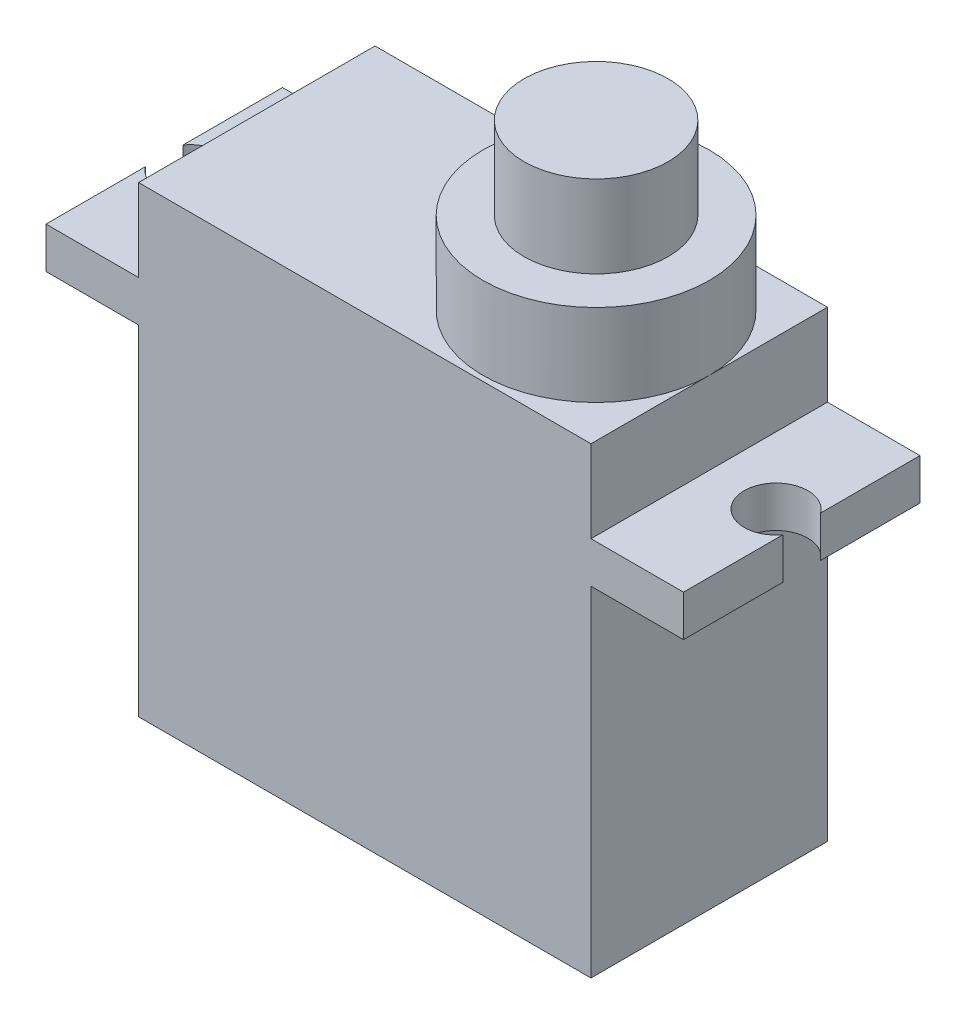
ISO-10303-21;
HEADER;
FILE_DESCRIPTION(('STEP AP214'),'2;1');
FILE_NAME('part.step','',(''),(''),'','','');
FILE_SCHEMA(('AUTOMOTIVE_DESIGN { 1 0 10303 214 1 1 1 1 }'));
ENDSEC;
DATA;
#1=APPLICATION_CONTEXT('core data for automotive mechanical design processes');
#2=APPLICATION_PROTOCOL_DEFINITION('international standard','automotive_design',2000,#1);
#3=PRODUCT_CONTEXT('',#1,'mechanical');
#4=PRODUCT('Part','Part','',(#3));
#5=PRODUCT_RELATED_PRODUCT_CATEGORY('part','',(#4));
#6=PRODUCT_DEFINITION_FORMATION('','',#4);
#7=PRODUCT_DEFINITION_CONTEXT('part definition',#1,'design');
#8=PRODUCT_DEFINITION('design','',#6,#7);
#9=PRODUCT_DEFINITION_SHAPE('','',#8);
#10=(LENGTH_UNIT() NAMED_UNIT(*) SI_UNIT(.MILLI.,.METRE.));
#11=(NAMED_UNIT(*) PLANE_ANGLE_UNIT() SI_UNIT($,.RADIAN.));
#12=(NAMED_UNIT(*) SI_UNIT($,.STERADIAN.) SOLID_ANGLE_UNIT());
#13=UNCERTAINTY_MEASURE_WITH_UNIT(LENGTH_MEASURE(1.E-05),#10,'distance_accuracy_value','');
#14=(GEOMETRIC_REPRESENTATION_CONTEXT(3) GLOBAL_UNCERTAINTY_ASSIGNED_CONTEXT((#13)) GLOBAL_UNIT_ASSIGNED_CONTEXT((#10,
#11,#12)) REPRESENTATION_CONTEXT('',''));
#15=CARTESIAN_POINT('',(0.,0.,0.));
#16=DIRECTION('',(0.,0.,1.));
#17=DIRECTION('',(1.,0.,0.));
#18=AXIS2_PLACEMENT_3D('',#15,#16,#17);
#19=CARTESIAN_POINT('',(-14.25,18.5,0.));
#20=DIRECTION('',(0.,1.,0.));
#21=DIRECTION('',(0.,0.,1.));
#22=AXIS2_PLACEMENT_3D('',#19,#20,#21);
#23=PLANE('',#22);
#24=DIRECTION('',(0.,0.,1.));
#25=VECTOR('',#24,1.);
#26=CARTESIAN_POINT('',(-11.,18.5,-5.75));
#27=LINE('',#26,#25);
#28=CARTESIAN_POINT('',(-11.,18.5,-5.75));
#29=VERTEX_POINT('',#28);
#30=CARTESIAN_POINT('',(-11.,18.5,5.75));
#31=VERTEX_POINT('',#30);
#32=EDGE_CURVE('E169',#29,#31,#27,.T.);
#33=ORIENTED_EDGE('',*,*,#32,.F.);
#34=DIRECTION('',(-1.,0.,0.));
#35=VECTOR('',#34,1.);
#36=CARTESIAN_POINT('',(-15.5,18.5,-5.75));
#37=LINE('',#36,#35);
#38=CARTESIAN_POINT('',(-15.5,18.5,-5.75));
#39=VERTEX_POINT('',#38);
#40=EDGE_CURVE('E197',#29,#39,#37,.T.);
#41=ORIENTED_EDGE('',*,*,#40,.T.);
#42=DIRECTION('',(0.,0.,1.));
#43=VECTOR('',#42,1.);
#44=CARTESIAN_POINT('',(-15.5,18.5,-5.75));
#45=LINE('',#44,#43);
#46=CARTESIAN_POINT('',(-15.5,18.5,-0.916515138991163));
#47=VERTEX_POINT('',#46);
#48=EDGE_CURVE('E200',#39,#47,#45,.T.);
#49=ORIENTED_EDGE('',*,*,#48,.T.);
#50=CARTESIAN_POINT('',(-14.25,18.5,0.));
#51=DIRECTION('',(0.,-1.,0.));
#52=DIRECTION('',(0.,0.,1.));
#53=AXIS2_PLACEMENT_3D('',#50,#51,#52);
#54=CIRCLE('',#53,1.55);
#55=CARTESIAN_POINT('',(-15.5,18.5,0.916515138991162));
#56=VERTEX_POINT('',#55);
#57=EDGE_CURVE('E202',#47,#56,#54,.T.);
#58=ORIENTED_EDGE('',*,*,#57,.T.);
#59=DIRECTION('',(0.,0.,1.));
#60=VECTOR('',#59,1.);
#61=CARTESIAN_POINT('',(-15.5,18.5,0.916515138991162));
#62=LINE('',#61,#60);
#63=CARTESIAN_POINT('',(-15.5,18.5,5.75));
#64=VERTEX_POINT('',#63);
#65=EDGE_CURVE('E204',#56,#64,#62,.T.);
#66=ORIENTED_EDGE('',*,*,#65,.T.);
#67=DIRECTION('',(1.,0.,0.));
#68=VECTOR('',#67,1.);
#69=CARTESIAN_POINT('',(-15.5,18.5,5.75));
#70=LINE('',#69,#68);
#71=EDGE_CURVE('E58',#64,#31,#70,.T.);
#72=ORIENTED_EDGE('',*,*,#71,.T.);
#73=EDGE_LOOP('',(#33,#41,#49,#58,#66,#72));
#74=FACE_BOUND('',#73,.T.);
#75=ADVANCED_FACE('F34',(#74),#23,.T.);
#76=CARTESIAN_POINT('',(-11.,16.5,-5.75));
#77=DIRECTION('',(1.,0.,0.));
#78=DIRECTION('',(0.,0.,-1.));
#79=AXIS2_PLACEMENT_3D('',#76,#77,#78);
#80=PLANE('',#79);
#81=DIRECTION('',(0.,0.,1.));
#82=VECTOR('',#81,1.);
#83=CARTESIAN_POINT('',(-11.,0.,-5.75));
#84=LINE('',#83,#82);
#85=CARTESIAN_POINT('',(-11.,0.,-5.75));
#86=VERTEX_POINT('',#85);
#87=CARTESIAN_POINT('',(-11.,0.,5.75));
#88=VERTEX_POINT('',#87);
#89=EDGE_CURVE('E251',#86,#88,#84,.T.);
#90=ORIENTED_EDGE('',*,*,#89,.T.);
#91=DIRECTION('',(0.,-1.,0.));
#92=VECTOR('',#91,1.);
#93=CARTESIAN_POINT('',(-11.,16.5,5.75));
#94=LINE('',#93,#92);
#95=CARTESIAN_POINT('',(-11.,16.5,5.75));
#96=VERTEX_POINT('',#95);
#97=EDGE_CURVE('E38',#96,#88,#94,.T.);
#98=ORIENTED_EDGE('',*,*,#97,.F.);
#99=DIRECTION('',(0.,0.,1.));
#100=VECTOR('',#99,1.);
#101=CARTESIAN_POINT('',(-11.,16.5,-5.75));
#102=LINE('',#101,#100);
#103=CARTESIAN_POINT('',(-11.,16.5,-5.75));
#104=VERTEX_POINT('',#103);
#105=EDGE_CURVE('E252',#104,#96,#102,.T.);
#106=ORIENTED_EDGE('',*,*,#105,.F.);
#107=DIRECTION('',(0.,-1.,0.));
#108=VECTOR('',#107,1.);
#109=CARTESIAN_POINT('',(-11.,16.5,-5.75));
#110=LINE('',#109,#108);
#111=EDGE_CURVE('E259',#104,#86,#110,.T.);
#112=ORIENTED_EDGE('',*,*,#111,.T.);
#113=EDGE_LOOP('',(#90,#98,#106,#112));
#114=FACE_BOUND('',#113,.T.);
#115=ADVANCED_FACE('F36',(#114),#80,.F.);
#116=CARTESIAN_POINT('',(-11.,16.5,5.75));
#117=DIRECTION('',(0.,0.,-1.));
#118=DIRECTION('',(-1.,0.,0.));
#119=AXIS2_PLACEMENT_3D('',#116,#117,#118);
#120=PLANE('',#119);
#121=DIRECTION('',(1.,0.,0.));
#122=VECTOR('',#121,1.);
#123=CARTESIAN_POINT('',(-11.,0.,5.75));
#124=LINE('',#123,#122);
#125=CARTESIAN_POINT('',(11.,0.,5.75));
#126=VERTEX_POINT('',#125);
#127=EDGE_CURVE('E262',#88,#126,#124,.T.);
#128=ORIENTED_EDGE('',*,*,#127,.T.);
#129=DIRECTION('',(0.,-1.,0.));
#130=VECTOR('',#129,1.);
#131=CARTESIAN_POINT('',(11.,16.5,5.75));
#132=LINE('',#131,#130);
#133=CARTESIAN_POINT('',(11.,16.5,5.75));
#134=VERTEX_POINT('',#133);
#135=EDGE_CURVE('E271',#134,#126,#132,.T.);
#136=ORIENTED_EDGE('',*,*,#135,.F.);
#137=DIRECTION('',(1.,0.,0.));
#138=VECTOR('',#137,1.);
#139=CARTESIAN_POINT('',(-15.5,16.5,5.75));
#140=LINE('',#139,#138);
#141=CARTESIAN_POINT('',(15.5,16.5,5.75000000000001));
#142=VERTEX_POINT('',#141);
#143=EDGE_CURVE('E225',#134,#142,#140,.T.);
#144=ORIENTED_EDGE('',*,*,#143,.T.);
#145=DIRECTION('',(0.,-1.,0.));
#146=VECTOR('',#145,1.);
#147=CARTESIAN_POINT('',(15.5,18.5,5.75000000000001));
#148=LINE('',#147,#146);
#149=CARTESIAN_POINT('',(15.5,18.5,5.75000000000001));
#150=VERTEX_POINT('',#149);
#151=EDGE_CURVE('E208',#150,#142,#148,.T.);
#152=ORIENTED_EDGE('',*,*,#151,.F.);
#153=CARTESIAN_POINT('',(11.,18.5,5.75000000000001));
#154=VERTEX_POINT('',#153);
#155=EDGE_CURVE('E206',#154,#150,#70,.T.);
#156=ORIENTED_EDGE('',*,*,#155,.F.);
#157=DIRECTION('',(0.,-1.,0.));
#158=VECTOR('',#157,1.);
#159=CARTESIAN_POINT('',(11.,22.5,5.75));
#160=LINE('',#159,#158);
#161=CARTESIAN_POINT('',(11.,22.5,5.75));
#162=VERTEX_POINT('',#161);
#163=EDGE_CURVE('E186',#162,#154,#160,.T.);
#164=ORIENTED_EDGE('',*,*,#163,.F.);
#165=DIRECTION('',(1.,0.,0.));
#166=VECTOR('',#165,1.);
#167=CARTESIAN_POINT('',(-11.,22.5,5.75));
#168=LINE('',#167,#166);
#169=CARTESIAN_POINT('',(-11.,22.5,5.75));
#170=VERTEX_POINT('',#169);
#171=EDGE_CURVE('E157',#170,#162,#168,.T.);
#172=ORIENTED_EDGE('',*,*,#171,.F.);
#173=DIRECTION('',(0.,-1.,0.));
#174=VECTOR('',#173,1.);
#175=CARTESIAN_POINT('',(-11.,22.5,5.75));
#176=LINE('',#175,#174);
#177=EDGE_CURVE('E176',#170,#31,#176,.T.);
#178=ORIENTED_EDGE('',*,*,#177,.T.);
#179=ORIENTED_EDGE('',*,*,#71,.F.);
#180=DIRECTION('',(0.,-1.,0.));
#181=VECTOR('',#180,1.);
#182=CARTESIAN_POINT('',(-15.5,18.5,5.75));
#183=LINE('',#182,#181);
#184=CARTESIAN_POINT('',(-15.5,16.5,5.75));
#185=VERTEX_POINT('',#184);
#186=EDGE_CURVE('E230',#64,#185,#183,.T.);
#187=ORIENTED_EDGE('',*,*,#186,.T.);
#188=EDGE_CURVE('E193',#185,#96,#140,.T.);
#189=ORIENTED_EDGE('',*,*,#188,.T.);
#190=ORIENTED_EDGE('',*,*,#97,.T.);
#191=EDGE_LOOP('',(#128,#136,#144,#152,#156,#164,#172,#178,#179,#187,#189,#190));
#192=FACE_BOUND('',#191,.T.);
#193=ADVANCED_FACE('F278',(#192),#120,.F.);
#194=CARTESIAN_POINT('',(11.,16.5,-5.75));
#195=DIRECTION('',(-1.,0.,0.));
#196=DIRECTION('',(0.,0.,1.));
#197=AXIS2_PLACEMENT_3D('',#194,#195,#196);
#198=PLANE('',#197);
#199=DIRECTION('',(0.,0.,-1.));
#200=VECTOR('',#199,1.);
#201=CARTESIAN_POINT('',(11.,0.,-5.75));
#202=LINE('',#201,#200);
#203=CARTESIAN_POINT('',(11.,0.,-5.75));
#204=VERTEX_POINT('',#203);
#205=EDGE_CURVE('E264',#126,#204,#202,.T.);
#206=ORIENTED_EDGE('',*,*,#205,.T.);
#207=DIRECTION('',(0.,-1.,0.));
#208=VECTOR('',#207,1.);
#209=CARTESIAN_POINT('',(11.,16.5,-5.75));
#210=LINE('',#209,#208);
#211=CARTESIAN_POINT('',(11.,16.5,-5.75000000000001));
#212=VERTEX_POINT('',#211);
#213=EDGE_CURVE('E269',#212,#204,#210,.T.);
#214=ORIENTED_EDGE('',*,*,#213,.F.);
#215=DIRECTION('',(0.,0.,-1.));
#216=VECTOR('',#215,1.);
#217=CARTESIAN_POINT('',(11.,16.5,-5.75));
#218=LINE('',#217,#216);
#219=EDGE_CURVE('E255',#134,#212,#218,.T.);
#220=ORIENTED_EDGE('',*,*,#219,.F.);
#221=ORIENTED_EDGE('',*,*,#135,.T.);
#222=EDGE_LOOP('',(#206,#214,#220,#221));
#223=FACE_BOUND('',#222,.T.);
#224=ADVANCED_FACE('F286',(#223),#198,.F.);
#225=CARTESIAN_POINT('',(-11.,16.5,-5.75));
#226=DIRECTION('',(0.,0.,1.));
#227=DIRECTION('',(1.,0.,0.));
#228=AXIS2_PLACEMENT_3D('',#225,#226,#227);
#229=PLANE('',#228);
#230=DIRECTION('',(-1.,0.,0.));
#231=VECTOR('',#230,1.);
#232=CARTESIAN_POINT('',(-11.,0.,-5.75));
#233=LINE('',#232,#231);
#234=EDGE_CURVE('E256',#204,#86,#233,.T.);
#235=ORIENTED_EDGE('',*,*,#234,.T.);
#236=ORIENTED_EDGE('',*,*,#111,.F.);
#237=DIRECTION('',(-1.,0.,0.));
#238=VECTOR('',#237,1.);
#239=CARTESIAN_POINT('',(-15.5,16.5,-5.75));
#240=LINE('',#239,#238);
#241=CARTESIAN_POINT('',(-15.5,16.5,-5.75));
#242=VERTEX_POINT('',#241);
#243=EDGE_CURVE('E215',#104,#242,#240,.T.);
#244=ORIENTED_EDGE('',*,*,#243,.T.);
#245=DIRECTION('',(0.,-1.,0.));
#246=VECTOR('',#245,1.);
#247=CARTESIAN_POINT('',(-15.5,18.5,-5.75));
#248=LINE('',#247,#246);
#249=EDGE_CURVE('E239',#39,#242,#248,.T.);
#250=ORIENTED_EDGE('',*,*,#249,.F.);
#251=ORIENTED_EDGE('',*,*,#40,.F.);
#252=DIRECTION('',(0.,-1.,0.));
#253=VECTOR('',#252,1.);
#254=CARTESIAN_POINT('',(-11.,22.5,-5.75));
#255=LINE('',#254,#253);
#256=CARTESIAN_POINT('',(-11.,22.5,-5.75));
#257=VERTEX_POINT('',#256);
#258=EDGE_CURVE('E182',#257,#29,#255,.T.);
#259=ORIENTED_EDGE('',*,*,#258,.F.);
#260=DIRECTION('',(-1.,0.,0.));
#261=VECTOR('',#260,1.);
#262=CARTESIAN_POINT('',(11.,22.5,-5.75));
#263=LINE('',#262,#261);
#264=CARTESIAN_POINT('',(11.,22.5,-5.75));
#265=VERTEX_POINT('',#264);
#266=EDGE_CURVE('E161',#265,#257,#263,.T.);
#267=ORIENTED_EDGE('',*,*,#266,.F.);
#268=DIRECTION('',(0.,-1.,0.));
#269=VECTOR('',#268,1.);
#270=CARTESIAN_POINT('',(11.,22.5,-5.75));
#271=LINE('',#270,#269);
#272=CARTESIAN_POINT('',(11.,18.5,-5.75));
#273=VERTEX_POINT('',#272);
#274=EDGE_CURVE('E167',#265,#273,#271,.T.);
#275=ORIENTED_EDGE('',*,*,#274,.T.);
#276=CARTESIAN_POINT('',(15.5,18.5,-5.75000000000001));
#277=VERTEX_POINT('',#276);
#278=EDGE_CURVE('E198',#277,#273,#37,.T.);
#279=ORIENTED_EDGE('',*,*,#278,.F.);
#280=DIRECTION('',(0.,-1.,0.));
#281=VECTOR('',#280,1.);
#282=CARTESIAN_POINT('',(15.5,18.5,-5.75000000000001));
#283=LINE('',#282,#281);
#284=CARTESIAN_POINT('',(15.5,16.5,-5.75000000000001));
#285=VERTEX_POINT('',#284);
#286=EDGE_CURVE('E242',#277,#285,#283,.T.);
#287=ORIENTED_EDGE('',*,*,#286,.T.);
#288=EDGE_CURVE('E216',#285,#212,#240,.T.);
#289=ORIENTED_EDGE('',*,*,#288,.T.);
#290=ORIENTED_EDGE('',*,*,#213,.T.);
#291=EDGE_LOOP('',(#235,#236,#244,#250,#251,#259,#267,#275,#279,#287,#289,#290));
#292=FACE_BOUND('',#291,.T.);
#293=ADVANCED_FACE('F288',(#292),#229,.F.);
#294=CARTESIAN_POINT('',(0.,0.,0.));
#295=DIRECTION('',(0.,1.,0.));
#296=DIRECTION('',(0.,0.,1.));
#297=AXIS2_PLACEMENT_3D('',#294,#295,#296);
#298=PLANE('',#297);
#299=ORIENTED_EDGE('',*,*,#89,.F.);
#300=ORIENTED_EDGE('',*,*,#234,.F.);
#301=ORIENTED_EDGE('',*,*,#205,.F.);
#302=ORIENTED_EDGE('',*,*,#127,.F.);
#303=EDGE_LOOP('',(#299,#300,#301,#302));
#304=FACE_BOUND('',#303,.T.);
#305=ADVANCED_FACE('F285',(#304),#298,.F.);
#306=CARTESIAN_POINT('',(-14.25,16.5,0.));
#307=DIRECTION('',(0.,1.,0.));
#308=DIRECTION('',(0.,0.,1.));
#309=AXIS2_PLACEMENT_3D('',#306,#307,#308);
#310=PLANE('',#309);
#311=ORIENTED_EDGE('',*,*,#243,.F.);
#312=ORIENTED_EDGE('',*,*,#105,.T.);
#313=ORIENTED_EDGE('',*,*,#188,.F.);
#314=DIRECTION('',(0.,0.,1.));
#315=VECTOR('',#314,1.);
#316=CARTESIAN_POINT('',(-15.5,16.5,0.916515138991162));
#317=LINE('',#316,#315);
#318=CARTESIAN_POINT('',(-15.5,16.5,0.916515138991162));
#319=VERTEX_POINT('',#318);
#320=EDGE_CURVE('E223',#319,#185,#317,.T.);
#321=ORIENTED_EDGE('',*,*,#320,.F.);
#322=CARTESIAN_POINT('',(-14.25,16.5,0.));
#323=DIRECTION('',(0.,-1.,0.));
#324=DIRECTION('',(0.,0.,1.));
#325=AXIS2_PLACEMENT_3D('',#322,#323,#324);
#326=CIRCLE('',#325,1.55);
#327=CARTESIAN_POINT('',(-15.5,16.5,-0.916515138991163));
#328=VERTEX_POINT('',#327);
#329=EDGE_CURVE('E221',#328,#319,#326,.T.);
#330=ORIENTED_EDGE('',*,*,#329,.F.);
#331=DIRECTION('',(0.,0.,1.));
#332=VECTOR('',#331,1.);
#333=CARTESIAN_POINT('',(-15.5,16.5,-5.75));
#334=LINE('',#333,#332);
#335=EDGE_CURVE('E219',#242,#328,#334,.T.);
#336=ORIENTED_EDGE('',*,*,#335,.F.);
#337=EDGE_LOOP('',(#311,#312,#313,#321,#330,#336));
#338=FACE_BOUND('',#337,.T.);
#339=ADVANCED_FACE('F316',(#338),#310,.F.);
#340=ORIENTED_EDGE('',*,*,#143,.F.);
#341=ORIENTED_EDGE('',*,*,#219,.T.);
#342=ORIENTED_EDGE('',*,*,#288,.F.);
#343=DIRECTION('',(0.,0.,-1.));
#344=VECTOR('',#343,1.);
#345=CARTESIAN_POINT('',(15.5,16.5,-5.75000000000001));
#346=LINE('',#345,#344);
#347=CARTESIAN_POINT('',(15.5,16.5,-0.916515138991161));
#348=VERTEX_POINT('',#347);
#349=EDGE_CURVE('E213',#348,#285,#346,.T.);
#350=ORIENTED_EDGE('',*,*,#349,.F.);
#351=CARTESIAN_POINT('',(14.25,16.5,0.));
#352=DIRECTION('',(0.,-1.,0.));
#353=DIRECTION('',(0.,0.,-1.));
#354=AXIS2_PLACEMENT_3D('',#351,#352,#353);
#355=CIRCLE('',#354,1.55);
#356=CARTESIAN_POINT('',(15.5,16.5,0.916515138991159));
#357=VERTEX_POINT('',#356);
#358=EDGE_CURVE('E211',#357,#348,#355,.T.);
#359=ORIENTED_EDGE('',*,*,#358,.F.);
#360=DIRECTION('',(0.,0.,-1.));
#361=VECTOR('',#360,1.);
#362=CARTESIAN_POINT('',(15.5,16.5,0.916515138991159));
#363=LINE('',#362,#361);
#364=EDGE_CURVE('E188',#142,#357,#363,.T.);
#365=ORIENTED_EDGE('',*,*,#364,.F.);
#366=EDGE_LOOP('',(#340,#341,#342,#350,#359,#365));
#367=FACE_BOUND('',#366,.T.);
#368=ADVANCED_FACE('F295',(#367),#310,.F.);
#369=CARTESIAN_POINT('',(15.5,18.5,0.916515138991159));
#370=DIRECTION('',(-1.,0.,0.));
#371=DIRECTION('',(0.,0.,1.));
#372=AXIS2_PLACEMENT_3D('',#369,#370,#371);
#373=PLANE('',#372);
#374=ORIENTED_EDGE('',*,*,#364,.T.);
#375=DIRECTION('',(0.,-1.,0.));
#376=VECTOR('',#375,1.);
#377=CARTESIAN_POINT('',(15.5,18.5,0.916515138991159));
#378=LINE('',#377,#376);
#379=CARTESIAN_POINT('',(15.5,18.5,0.916515138991159));
#380=VERTEX_POINT('',#379);
#381=EDGE_CURVE('E248',#380,#357,#378,.T.);
#382=ORIENTED_EDGE('',*,*,#381,.F.);
#383=DIRECTION('',(0.,0.,-1.));
#384=VECTOR('',#383,1.);
#385=CARTESIAN_POINT('',(15.5,18.5,0.916515138991159));
#386=LINE('',#385,#384);
#387=EDGE_CURVE('E189',#150,#380,#386,.T.);
#388=ORIENTED_EDGE('',*,*,#387,.F.);
#389=ORIENTED_EDGE('',*,*,#151,.T.);
#390=EDGE_LOOP('',(#374,#382,#388,#389));
#391=FACE_BOUND('',#390,.T.);
#392=ADVANCED_FACE('F300',(#391),#373,.F.);
#393=CARTESIAN_POINT('',(14.25,18.5,0.));
#394=DIRECTION('',(0.,-1.,0.));
#395=DIRECTION('',(0.,0.,-1.));
#396=AXIS2_PLACEMENT_3D('',#393,#394,#395);
#397=CYLINDRICAL_SURFACE('',#396,1.55);
#398=ORIENTED_EDGE('',*,*,#358,.T.);
#399=DIRECTION('',(0.,-1.,0.));
#400=VECTOR('',#399,1.);
#401=CARTESIAN_POINT('',(15.5,18.5,-0.916515138991161));
#402=LINE('',#401,#400);
#403=CARTESIAN_POINT('',(15.5,18.5,-0.916515138991161));
#404=VERTEX_POINT('',#403);
#405=EDGE_CURVE('E245',#404,#348,#402,.T.);
#406=ORIENTED_EDGE('',*,*,#405,.F.);
#407=CARTESIAN_POINT('',(14.25,18.5,0.));
#408=DIRECTION('',(0.,-1.,0.));
#409=DIRECTION('',(0.,0.,-1.));
#410=AXIS2_PLACEMENT_3D('',#407,#408,#409);
#411=CIRCLE('',#410,1.55);
#412=EDGE_CURVE('E192',#380,#404,#411,.T.);
#413=ORIENTED_EDGE('',*,*,#412,.F.);
#414=ORIENTED_EDGE('',*,*,#381,.T.);
#415=EDGE_LOOP('',(#398,#406,#413,#414));
#416=FACE_BOUND('',#415,.T.);
#417=ADVANCED_FACE('F495',(#416),#397,.F.);
#418=CARTESIAN_POINT('',(15.5,18.5,-5.75000000000001));
#419=DIRECTION('',(-1.,0.,0.));
#420=DIRECTION('',(0.,0.,1.));
#421=AXIS2_PLACEMENT_3D('',#418,#419,#420);
#422=PLANE('',#421);
#423=ORIENTED_EDGE('',*,*,#349,.T.);
#424=ORIENTED_EDGE('',*,*,#286,.F.);
#425=DIRECTION('',(0.,0.,-1.));
#426=VECTOR('',#425,1.);
#427=CARTESIAN_POINT('',(15.5,18.5,-5.75000000000001));
#428=LINE('',#427,#426);
#429=EDGE_CURVE('E195',#404,#277,#428,.T.);
#430=ORIENTED_EDGE('',*,*,#429,.F.);
#431=ORIENTED_EDGE('',*,*,#405,.T.);
#432=EDGE_LOOP('',(#423,#424,#430,#431));
#433=FACE_BOUND('',#432,.T.);
#434=ADVANCED_FACE('F502',(#433),#422,.F.);
#435=CARTESIAN_POINT('',(-15.5,18.5,-5.75));
#436=DIRECTION('',(1.,0.,0.));
#437=DIRECTION('',(0.,0.,-1.));
#438=AXIS2_PLACEMENT_3D('',#435,#436,#437);
#439=PLANE('',#438);
#440=ORIENTED_EDGE('',*,*,#335,.T.);
#441=DIRECTION('',(0.,-1.,0.));
#442=VECTOR('',#441,1.);
#443=CARTESIAN_POINT('',(-15.5,18.5,-0.916515138991163));
#444=LINE('',#443,#442);
#445=EDGE_CURVE('E236',#47,#328,#444,.T.);
#446=ORIENTED_EDGE('',*,*,#445,.F.);
#447=ORIENTED_EDGE('',*,*,#48,.F.);
#448=ORIENTED_EDGE('',*,*,#249,.T.);
#449=EDGE_LOOP('',(#440,#446,#447,#448));
#450=FACE_BOUND('',#449,.T.);
#451=ADVANCED_FACE('F322',(#450),#439,.F.);
#452=CARTESIAN_POINT('',(-14.25,18.5,0.));
#453=DIRECTION('',(0.,-1.,0.));
#454=DIRECTION('',(0.,0.,-1.));
#455=AXIS2_PLACEMENT_3D('',#452,#453,#454);
#456=CYLINDRICAL_SURFACE('',#455,1.55);
#457=ORIENTED_EDGE('',*,*,#329,.T.);
#458=DIRECTION('',(0.,-1.,0.));
#459=VECTOR('',#458,1.);
#460=CARTESIAN_POINT('',(-15.5,18.5,0.916515138991162));
#461=LINE('',#460,#459);
#462=EDGE_CURVE('E233',#56,#319,#461,.T.);
#463=ORIENTED_EDGE('',*,*,#462,.F.);
#464=ORIENTED_EDGE('',*,*,#57,.F.);
#465=ORIENTED_EDGE('',*,*,#445,.T.);
#466=EDGE_LOOP('',(#457,#463,#464,#465));
#467=FACE_BOUND('',#466,.T.);
#468=ADVANCED_FACE('F327',(#467),#456,.F.);
#469=CARTESIAN_POINT('',(-15.5,18.5,0.916515138991162));
#470=DIRECTION('',(1.,0.,0.));
#471=DIRECTION('',(0.,0.,-1.));
#472=AXIS2_PLACEMENT_3D('',#469,#470,#471);
#473=PLANE('',#472);
#474=ORIENTED_EDGE('',*,*,#320,.T.);
#475=ORIENTED_EDGE('',*,*,#186,.F.);
#476=ORIENTED_EDGE('',*,*,#65,.F.);
#477=ORIENTED_EDGE('',*,*,#462,.T.);
#478=EDGE_LOOP('',(#474,#475,#476,#477));
#479=FACE_BOUND('',#478,.T.);
#480=ADVANCED_FACE('F328',(#479),#473,.F.);
#481=DIRECTION('',(0.,0.,-1.));
#482=VECTOR('',#481,1.);
#483=CARTESIAN_POINT('',(11.,18.5,5.75));
#484=LINE('',#483,#482);
#485=EDGE_CURVE('E50',#154,#273,#484,.T.);
#486=ORIENTED_EDGE('',*,*,#485,.F.);
#487=ORIENTED_EDGE('',*,*,#155,.T.);
#488=ORIENTED_EDGE('',*,*,#387,.T.);
#489=ORIENTED_EDGE('',*,*,#412,.T.);
#490=ORIENTED_EDGE('',*,*,#429,.T.);
#491=ORIENTED_EDGE('',*,*,#278,.T.);
#492=EDGE_LOOP('',(#486,#487,#488,#489,#490,#491));
#493=FACE_BOUND('',#492,.T.);
#494=ADVANCED_FACE('F302',(#493),#23,.T.);
#495=CARTESIAN_POINT('',(11.,22.5,5.75));
#496=DIRECTION('',(-1.,0.,0.));
#497=DIRECTION('',(0.,0.,1.));
#498=AXIS2_PLACEMENT_3D('',#495,#496,#497);
#499=PLANE('',#498);
#500=ORIENTED_EDGE('',*,*,#485,.T.);
#501=ORIENTED_EDGE('',*,*,#274,.F.);
#502=DIRECTION('',(0.,0.,-1.));
#503=VECTOR('',#502,1.);
#504=CARTESIAN_POINT('',(11.,22.5,5.75));
#505=LINE('',#504,#503);
#506=CARTESIAN_POINT('',(11.,22.5,0.));
#507=VERTEX_POINT('',#506);
#508=EDGE_CURVE('E162',#507,#265,#505,.T.);
#509=ORIENTED_EDGE('',*,*,#508,.F.);
#510=EDGE_CURVE('E151',#162,#507,#505,.T.);
#511=ORIENTED_EDGE('',*,*,#510,.F.);
#512=ORIENTED_EDGE('',*,*,#163,.T.);
#513=EDGE_LOOP('',(#500,#501,#509,#511,#512));
#514=FACE_BOUND('',#513,.T.);
#515=ADVANCED_FACE('F165',(#514),#499,.F.);
#516=CARTESIAN_POINT('',(-11.,22.5,-5.75));
#517=DIRECTION('',(1.,0.,0.));
#518=DIRECTION('',(0.,0.,-1.));
#519=AXIS2_PLACEMENT_3D('',#516,#517,#518);
#520=PLANE('',#519);
#521=ORIENTED_EDGE('',*,*,#32,.T.);
#522=ORIENTED_EDGE('',*,*,#177,.F.);
#523=DIRECTION('',(0.,0.,1.));
#524=VECTOR('',#523,1.);
#525=CARTESIAN_POINT('',(-11.,22.5,-5.75));
#526=LINE('',#525,#524);
#527=EDGE_CURVE('E174',#257,#170,#526,.T.);
#528=ORIENTED_EDGE('',*,*,#527,.F.);
#529=ORIENTED_EDGE('',*,*,#258,.T.);
#530=EDGE_LOOP('',(#521,#522,#528,#529));
#531=FACE_BOUND('',#530,.T.);
#532=ADVANCED_FACE('F309',(#531),#520,.F.);
#533=CARTESIAN_POINT('',(0.,22.5,0.));
#534=DIRECTION('',(0.,1.,0.));
#535=DIRECTION('',(0.,0.,1.));
#536=AXIS2_PLACEMENT_3D('',#533,#534,#535);
#537=PLANE('',#536);
#538=ORIENTED_EDGE('',*,*,#510,.T.);
#539=CARTESIAN_POINT('',(5.5,22.5,0.));
#540=DIRECTION('',(0.,1.,0.));
#541=DIRECTION('',(0.,0.,1.));
#542=AXIS2_PLACEMENT_3D('',#539,#540,#541);
#543=CIRCLE('',#542,5.5);
#544=EDGE_CURVE('E155',#507,#507,#543,.T.);
#545=ORIENTED_EDGE('',*,*,#544,.F.);
#546=ORIENTED_EDGE('',*,*,#508,.T.);
#547=ORIENTED_EDGE('',*,*,#266,.T.);
#548=ORIENTED_EDGE('',*,*,#527,.T.);
#549=ORIENTED_EDGE('',*,*,#171,.T.);
#550=EDGE_LOOP('',(#538,#545,#546,#547,#548,#549));
#551=FACE_BOUND('',#550,.T.);
#552=ADVANCED_FACE('F153',(#551),#537,.T.);
#553=CARTESIAN_POINT('',(5.5,26.5,0.));
#554=DIRECTION('',(0.,-1.,0.));
#555=DIRECTION('',(0.,0.,-1.));
#556=AXIS2_PLACEMENT_3D('',#553,#554,#555);
#557=CYLINDRICAL_SURFACE('',#556,5.5);
#558=CARTESIAN_POINT('',(5.5,26.5,0.));
#559=DIRECTION('',(0.,1.,0.));
#560=DIRECTION('',(0.,0.,1.));
#561=AXIS2_PLACEMENT_3D('',#558,#559,#560);
#562=CIRCLE('',#561,5.5);
#563=CARTESIAN_POINT('',(5.5,26.5,5.5));
#564=VERTEX_POINT('',#563);
#565=EDGE_CURVE('E178',#564,#564,#562,.T.);
#566=ORIENTED_EDGE('',*,*,#565,.F.);
#567=EDGE_LOOP('',(#566));
#568=FACE_BOUND('',#567,.T.);
#569=ORIENTED_EDGE('',*,*,#544,.T.);
#570=EDGE_LOOP('',(#569));
#571=FACE_BOUND('',#570,.T.);
#572=ADVANCED_FACE('F403',(#568,#571),#557,.T.);
#573=CARTESIAN_POINT('',(5.5,26.5,0.));
#574=DIRECTION('',(0.,1.,0.));
#575=DIRECTION('',(0.,0.,1.));
#576=AXIS2_PLACEMENT_3D('',#573,#574,#575);
#577=PLANE('',#576);
#578=CARTESIAN_POINT('',(5.5,26.5,0.));
#579=DIRECTION('',(0.,1.,0.));
#580=DIRECTION('',(0.,0.,1.));
#581=AXIS2_PLACEMENT_3D('',#578,#579,#580);
#582=CIRCLE('',#581,3.5);
#583=CARTESIAN_POINT('',(5.5,26.5,3.5));
#584=VERTEX_POINT('',#583);
#585=EDGE_CURVE('E11',#584,#584,#582,.T.);
#586=ORIENTED_EDGE('',*,*,#585,.F.);
#587=EDGE_LOOP('',(#586));
#588=FACE_BOUND('',#587,.T.);
#589=ORIENTED_EDGE('',*,*,#565,.T.);
#590=EDGE_LOOP('',(#589));
#591=FACE_BOUND('',#590,.T.);
#592=ADVANCED_FACE('F412',(#588,#591),#577,.T.);
#593=CARTESIAN_POINT('',(5.5,30.5,0.));
#594=DIRECTION('',(0.,-1.,0.));
#595=DIRECTION('',(0.,0.,-1.));
#596=AXIS2_PLACEMENT_3D('',#593,#594,#595);
#597=CYLINDRICAL_SURFACE('',#596,3.5);
#598=CARTESIAN_POINT('',(5.5,30.5,0.));
#599=DIRECTION('',(0.,1.,0.));
#600=DIRECTION('',(0.,0.,1.));
#601=AXIS2_PLACEMENT_3D('',#598,#599,#600);
#602=CIRCLE('',#601,3.5);
#603=CARTESIAN_POINT('',(5.5,30.5,3.5));
#604=VERTEX_POINT('',#603);
#605=EDGE_CURVE('E448',#604,#604,#602,.T.);
#606=ORIENTED_EDGE('',*,*,#605,.F.);
#607=EDGE_LOOP('',(#606));
#608=FACE_BOUND('',#607,.T.);
#609=ORIENTED_EDGE('',*,*,#585,.T.);
#610=EDGE_LOOP('',(#609));
#611=FACE_BOUND('',#610,.T.);
#612=ADVANCED_FACE('F422',(#608,#611),#597,.T.);
#613=CARTESIAN_POINT('',(5.5,30.5,0.));
#614=DIRECTION('',(0.,1.,0.));
#615=DIRECTION('',(0.,0.,1.));
#616=AXIS2_PLACEMENT_3D('',#613,#614,#615);
#617=PLANE('',#616);
#618=ORIENTED_EDGE('',*,*,#605,.T.);
#619=EDGE_LOOP('',(#618));
#620=FACE_BOUND('',#619,.T.);
#621=ADVANCED_FACE('F432',(#620),#617,.T.);
#622=CLOSED_SHELL('',(#75,#115,#193,#224,#293,#305,#339,#368,#392,#417,#434,#451,#468,#480,#494,
#515,#532,#552,#572,#592,#612,#621));
#623=MANIFOLD_SOLID_BREP('B2',#622);
#624=ADVANCED_BREP_SHAPE_REPRESENTATION('',(#18,#623),#14);
#625=SHAPE_DEFINITION_REPRESENTATION(#9,#624);
ENDSEC;
END-ISO-10303-21;
